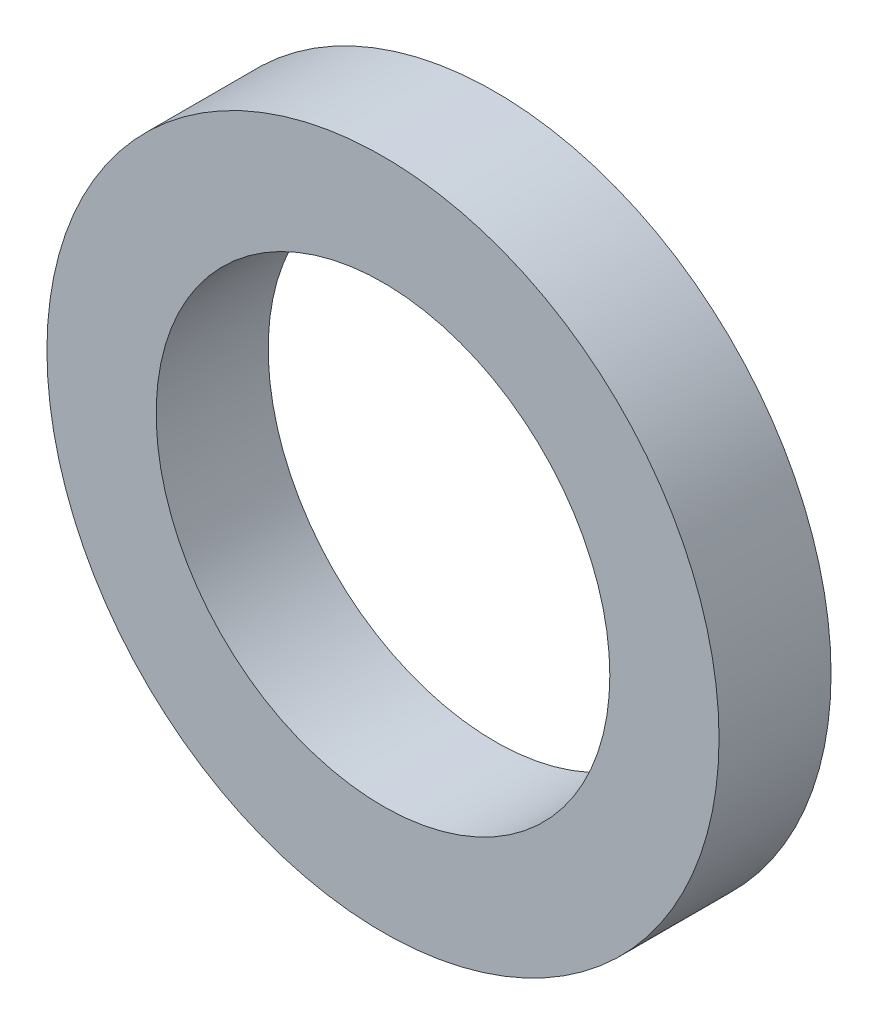
ISO-10303-21;
HEADER;
FILE_DESCRIPTION(('STEP AP214'),'2;1');
FILE_NAME('part.step','',(''),(''),'','','');
FILE_SCHEMA(('AUTOMOTIVE_DESIGN { 1 0 10303 214 1 1 1 1 }'));
ENDSEC;
DATA;
#1=APPLICATION_CONTEXT('core data for automotive mechanical design processes');
#2=APPLICATION_PROTOCOL_DEFINITION('international standard','automotive_design',2000,#1);
#3=PRODUCT_CONTEXT('',#1,'mechanical');
#4=PRODUCT('Part','Part','',(#3));
#5=PRODUCT_RELATED_PRODUCT_CATEGORY('part','',(#4));
#6=PRODUCT_DEFINITION_FORMATION('','',#4);
#7=PRODUCT_DEFINITION_CONTEXT('part definition',#1,'design');
#8=PRODUCT_DEFINITION('design','',#6,#7);
#9=PRODUCT_DEFINITION_SHAPE('','',#8);
#10=(LENGTH_UNIT() NAMED_UNIT(*) SI_UNIT(.MILLI.,.METRE.));
#11=(NAMED_UNIT(*) PLANE_ANGLE_UNIT() SI_UNIT($,.RADIAN.));
#12=(NAMED_UNIT(*) SI_UNIT($,.STERADIAN.) SOLID_ANGLE_UNIT());
#13=UNCERTAINTY_MEASURE_WITH_UNIT(LENGTH_MEASURE(1.E-05),#10,'distance_accuracy_value','');
#14=(GEOMETRIC_REPRESENTATION_CONTEXT(3) GLOBAL_UNCERTAINTY_ASSIGNED_CONTEXT((#13)) GLOBAL_UNIT_ASSIGNED_CONTEXT((#10,
#11,#12)) REPRESENTATION_CONTEXT('',''));
#15=CARTESIAN_POINT('',(0.,0.,0.));
#16=DIRECTION('',(0.,0.,1.));
#17=DIRECTION('',(1.,0.,0.));
#18=AXIS2_PLACEMENT_3D('',#15,#16,#17);
#19=CARTESIAN_POINT('',(0.,0.,1.));
#20=DIRECTION('',(0.,0.,1.));
#21=DIRECTION('',(1.,0.,0.));
#22=AXIS2_PLACEMENT_3D('',#19,#20,#21);
#23=PLANE('',#22);
#24=CARTESIAN_POINT('',(0.,0.,1.));
#25=DIRECTION('',(0.,0.,1.));
#26=DIRECTION('',(1.,0.,0.));
#27=AXIS2_PLACEMENT_3D('',#24,#25,#26);
#28=CIRCLE('',#27,3.);
#29=CARTESIAN_POINT('',(3.,0.,1.));
#30=VERTEX_POINT('',#29);
#31=EDGE_CURVE('E10',#30,#30,#28,.T.);
#32=ORIENTED_EDGE('',*,*,#31,.T.);
#33=EDGE_LOOP('',(#32));
#34=FACE_BOUND('',#33,.T.);
#35=CARTESIAN_POINT('',(0.,0.,1.));
#36=DIRECTION('',(0.,0.,1.));
#37=DIRECTION('',(1.,0.,0.));
#38=AXIS2_PLACEMENT_3D('',#35,#36,#37);
#39=CIRCLE('',#38,2.025);
#40=CARTESIAN_POINT('',(2.025,0.,1.));
#41=VERTEX_POINT('',#40);
#42=EDGE_CURVE('E42',#41,#41,#39,.T.);
#43=ORIENTED_EDGE('',*,*,#42,.F.);
#44=EDGE_LOOP('',(#43));
#45=FACE_BOUND('',#44,.T.);
#46=ADVANCED_FACE('F31',(#34,#45),#23,.T.);
#47=CARTESIAN_POINT('',(0.,0.,0.));
#48=DIRECTION('',(0.,0.,1.));
#49=DIRECTION('',(1.,0.,0.));
#50=AXIS2_PLACEMENT_3D('',#47,#48,#49);
#51=PLANE('',#50);
#52=CARTESIAN_POINT('',(0.,0.,0.));
#53=DIRECTION('',(0.,0.,1.));
#54=DIRECTION('',(1.,0.,0.));
#55=AXIS2_PLACEMENT_3D('',#52,#53,#54);
#56=CIRCLE('',#55,3.);
#57=CARTESIAN_POINT('',(3.,0.,0.));
#58=VERTEX_POINT('',#57);
#59=EDGE_CURVE('E35',#58,#58,#56,.T.);
#60=ORIENTED_EDGE('',*,*,#59,.F.);
#61=EDGE_LOOP('',(#60));
#62=FACE_BOUND('',#61,.T.);
#63=CARTESIAN_POINT('',(0.,0.,0.));
#64=DIRECTION('',(0.,0.,1.));
#65=DIRECTION('',(1.,0.,0.));
#66=AXIS2_PLACEMENT_3D('',#63,#64,#65);
#67=CIRCLE('',#66,2.025);
#68=CARTESIAN_POINT('',(2.025,0.,0.));
#69=VERTEX_POINT('',#68);
#70=EDGE_CURVE('E44',#69,#69,#67,.T.);
#71=ORIENTED_EDGE('',*,*,#70,.T.);
#72=EDGE_LOOP('',(#71));
#73=FACE_BOUND('',#72,.T.);
#74=ADVANCED_FACE('F54',(#62,#73),#51,.F.);
#75=CARTESIAN_POINT('',(0.,0.,1.));
#76=DIRECTION('',(0.,0.,-1.));
#77=DIRECTION('',(-1.,0.,0.));
#78=AXIS2_PLACEMENT_3D('',#75,#76,#77);
#79=CYLINDRICAL_SURFACE('',#78,3.);
#80=ORIENTED_EDGE('',*,*,#31,.F.);
#81=EDGE_LOOP('',(#80));
#82=FACE_BOUND('',#81,.T.);
#83=ORIENTED_EDGE('',*,*,#59,.T.);
#84=EDGE_LOOP('',(#83));
#85=FACE_BOUND('',#84,.T.);
#86=ADVANCED_FACE('F33',(#82,#85),#79,.T.);
#87=CARTESIAN_POINT('',(0.,0.,1.));
#88=DIRECTION('',(0.,0.,-1.));
#89=DIRECTION('',(-1.,0.,0.));
#90=AXIS2_PLACEMENT_3D('',#87,#88,#89);
#91=CYLINDRICAL_SURFACE('',#90,2.025);
#92=ORIENTED_EDGE('',*,*,#42,.T.);
#93=EDGE_LOOP('',(#92));
#94=FACE_BOUND('',#93,.T.);
#95=ORIENTED_EDGE('',*,*,#70,.F.);
#96=EDGE_LOOP('',(#95));
#97=FACE_BOUND('',#96,.T.);
#98=ADVANCED_FACE('F50',(#94,#97),#91,.F.);
#99=CLOSED_SHELL('',(#46,#74,#86,#98));
#100=MANIFOLD_SOLID_BREP('B2',#99);
#101=ADVANCED_BREP_SHAPE_REPRESENTATION('',(#18,#100),#14);
#102=SHAPE_DEFINITION_REPRESENTATION(#9,#101);
ENDSEC;
END-ISO-10303-21;
